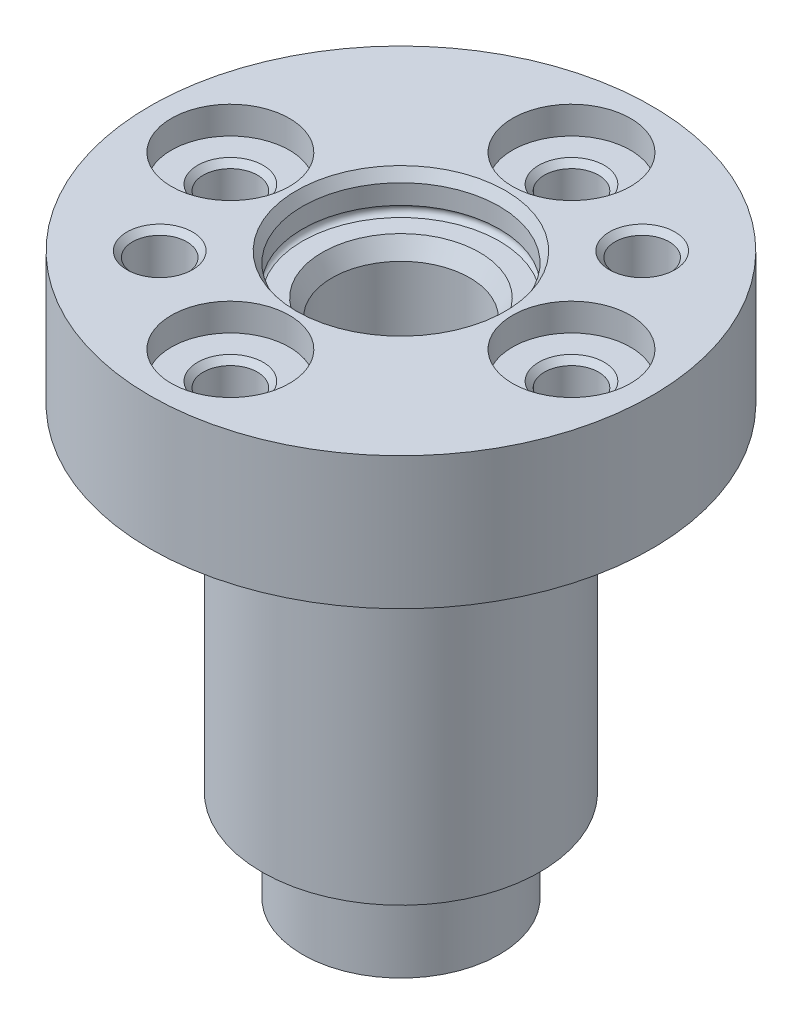
ISO-10303-21;
HEADER;
FILE_DESCRIPTION(('STEP AP214'),'2;1');
FILE_NAME('part.step','',(''),(''),'','','');
FILE_SCHEMA(('AUTOMOTIVE_DESIGN { 1 0 10303 214 1 1 1 1 }'));
ENDSEC;
DATA;
#1=APPLICATION_CONTEXT('core data for automotive mechanical design processes');
#2=APPLICATION_PROTOCOL_DEFINITION('international standard','automotive_design',2000,#1);
#3=PRODUCT_CONTEXT('',#1,'mechanical');
#4=PRODUCT('Part','Part','',(#3));
#5=PRODUCT_RELATED_PRODUCT_CATEGORY('part','',(#4));
#6=PRODUCT_DEFINITION_FORMATION('','',#4);
#7=PRODUCT_DEFINITION_CONTEXT('part definition',#1,'design');
#8=PRODUCT_DEFINITION('design','',#6,#7);
#9=PRODUCT_DEFINITION_SHAPE('','',#8);
#10=(LENGTH_UNIT() NAMED_UNIT(*) SI_UNIT(.MILLI.,.METRE.));
#11=(NAMED_UNIT(*) PLANE_ANGLE_UNIT() SI_UNIT($,.RADIAN.));
#12=(NAMED_UNIT(*) SI_UNIT($,.STERADIAN.) SOLID_ANGLE_UNIT());
#13=UNCERTAINTY_MEASURE_WITH_UNIT(LENGTH_MEASURE(1.E-05),#10,'distance_accuracy_value','');
#14=(GEOMETRIC_REPRESENTATION_CONTEXT(3) GLOBAL_UNCERTAINTY_ASSIGNED_CONTEXT((#13)) GLOBAL_UNIT_ASSIGNED_CONTEXT((#10,
#11,#12)) REPRESENTATION_CONTEXT('',''));
#15=CARTESIAN_POINT('',(0.,0.,0.));
#16=DIRECTION('',(0.,0.,1.));
#17=DIRECTION('',(1.,0.,0.));
#18=AXIS2_PLACEMENT_3D('',#15,#16,#17);
#19=CARTESIAN_POINT('',(0.,0.,0.));
#20=DIRECTION('',(0.,1.,0.));
#21=DIRECTION('',(0.,0.,1.));
#22=AXIS2_PLACEMENT_3D('',#19,#20,#21);
#23=CYLINDRICAL_SURFACE('',#22,10.6);
#24=CARTESIAN_POINT('',(0.,7.,0.));
#25=DIRECTION('',(0.,1.,0.));
#26=DIRECTION('',(0.,0.,1.));
#27=AXIS2_PLACEMENT_3D('',#24,#25,#26);
#28=CIRCLE('',#27,10.6);
#29=CARTESIAN_POINT('',(0.,7.,10.6));
#30=VERTEX_POINT('',#29);
#31=EDGE_CURVE('E145',#30,#30,#28,.T.);
#32=ORIENTED_EDGE('',*,*,#31,.T.);
#33=EDGE_LOOP('',(#32));
#34=FACE_BOUND('',#33,.T.);
#35=CARTESIAN_POINT('',(0.,32.6,0.));
#36=DIRECTION('',(0.,1.,0.));
#37=DIRECTION('',(0.,0.,1.));
#38=AXIS2_PLACEMENT_3D('',#35,#36,#37);
#39=CIRCLE('',#38,10.6);
#40=CARTESIAN_POINT('',(0.,32.6,10.6));
#41=VERTEX_POINT('',#40);
#42=EDGE_CURVE('E140',#41,#41,#39,.T.);
#43=ORIENTED_EDGE('',*,*,#42,.F.);
#44=EDGE_LOOP('',(#43));
#45=FACE_BOUND('',#44,.T.);
#46=DIRECTION('',(0.,1.,0.));
#47=VECTOR('',#46,1.);
#48=CARTESIAN_POINT('',(-10.5741789327541,0.,-0.739418621687728));
#49=LINE('',#48,#47);
#50=CARTESIAN_POINT('',(-10.5741789327541,27.6,-0.739418621687729));
#51=VERTEX_POINT('',#50);
#52=CARTESIAN_POINT('',(-10.5741789327541,22.6,-0.739418621687728));
#53=VERTEX_POINT('',#52);
#54=EDGE_CURVE('E11',#51,#53,#49,.F.);
#55=ORIENTED_EDGE('',*,*,#54,.F.);
#56=CARTESIAN_POINT('',(0.,27.6,0.));
#57=DIRECTION('',(0.,-1.,0.));
#58=DIRECTION('',(0.,0.,-1.));
#59=AXIS2_PLACEMENT_3D('',#56,#57,#58);
#60=CIRCLE('',#59,10.6);
#61=CARTESIAN_POINT('',(-10.5741789327541,27.6,0.739418621687729));
#62=VERTEX_POINT('',#61);
#63=EDGE_CURVE('E51',#62,#51,#60,.T.);
#64=ORIENTED_EDGE('',*,*,#63,.F.);
#65=DIRECTION('',(0.,1.,0.));
#66=VECTOR('',#65,1.);
#67=CARTESIAN_POINT('',(-10.5741789327541,0.,0.739418621687728));
#68=LINE('',#67,#66);
#69=CARTESIAN_POINT('',(-10.5741789327541,22.6,0.739418621687728));
#70=VERTEX_POINT('',#69);
#71=EDGE_CURVE('E142',#62,#70,#68,.F.);
#72=ORIENTED_EDGE('',*,*,#71,.T.);
#73=CARTESIAN_POINT('',(0.,22.6,0.));
#74=DIRECTION('',(0.,1.,0.));
#75=DIRECTION('',(0.,0.,1.));
#76=AXIS2_PLACEMENT_3D('',#73,#74,#75);
#77=CIRCLE('',#76,10.6);
#78=EDGE_CURVE('E151',#53,#70,#77,.T.);
#79=ORIENTED_EDGE('',*,*,#78,.F.);
#80=EDGE_LOOP('',(#55,#64,#72,#79));
#81=FACE_BOUND('',#80,.T.);
#82=ADVANCED_FACE('F43',(#34,#45,#81),#23,.T.);
#83=CARTESIAN_POINT('',(0.,42.7,0.));
#84=DIRECTION('',(0.,-1.,0.));
#85=DIRECTION('',(0.,0.,-1.));
#86=AXIS2_PLACEMENT_3D('',#83,#84,#85);
#87=PLANE('',#86);
#88=CARTESIAN_POINT('',(-9.19238815542515,42.7,9.19238815542515));
#89=DIRECTION('',(0.,1.,0.));
#90=DIRECTION('',(0.,0.,1.));
#91=AXIS2_PLACEMENT_3D('',#88,#89,#90);
#92=CIRCLE('',#91,2.50000000000001);
#93=CARTESIAN_POINT('',(-9.19238815542515,42.7,11.6923881554252));
#94=VERTEX_POINT('',#93);
#95=EDGE_CURVE('E346',#94,#94,#92,.T.);
#96=ORIENTED_EDGE('',*,*,#95,.F.);
#97=EDGE_LOOP('',(#96));
#98=FACE_BOUND('',#97,.T.);
#99=CARTESIAN_POINT('',(9.19238815542515,42.7,-9.19238815542515));
#100=DIRECTION('',(0.,1.,0.));
#101=DIRECTION('',(0.,0.,1.));
#102=AXIS2_PLACEMENT_3D('',#99,#100,#101);
#103=CIRCLE('',#102,2.50000000000001);
#104=CARTESIAN_POINT('',(9.19238815542515,42.7,-6.69238815542515));
#105=VERTEX_POINT('',#104);
#106=EDGE_CURVE('E361',#105,#105,#103,.T.);
#107=ORIENTED_EDGE('',*,*,#106,.F.);
#108=EDGE_LOOP('',(#107));
#109=FACE_BOUND('',#108,.T.);
#110=CARTESIAN_POINT('',(0.,42.7,13.));
#111=DIRECTION('',(0.,1.,0.));
#112=DIRECTION('',(0.,0.,1.));
#113=AXIS2_PLACEMENT_3D('',#110,#111,#112);
#114=CIRCLE('',#113,4.5);
#115=CARTESIAN_POINT('',(0.,42.7,17.5));
#116=VERTEX_POINT('',#115);
#117=EDGE_CURVE('E376',#116,#116,#114,.T.);
#118=ORIENTED_EDGE('',*,*,#117,.F.);
#119=EDGE_LOOP('',(#118));
#120=FACE_BOUND('',#119,.T.);
#121=CARTESIAN_POINT('',(0.,42.7,-13.));
#122=DIRECTION('',(0.,1.,0.));
#123=DIRECTION('',(0.,0.,1.));
#124=AXIS2_PLACEMENT_3D('',#121,#122,#123);
#125=CIRCLE('',#124,4.5);
#126=CARTESIAN_POINT('',(0.,42.7,-8.5));
#127=VERTEX_POINT('',#126);
#128=EDGE_CURVE('E391',#127,#127,#125,.T.);
#129=ORIENTED_EDGE('',*,*,#128,.F.);
#130=EDGE_LOOP('',(#129));
#131=FACE_BOUND('',#130,.T.);
#132=CARTESIAN_POINT('',(-13.,42.7,0.));
#133=DIRECTION('',(0.,1.,0.));
#134=DIRECTION('',(0.,0.,1.));
#135=AXIS2_PLACEMENT_3D('',#132,#133,#134);
#136=CIRCLE('',#135,4.5);
#137=CARTESIAN_POINT('',(-13.,42.7,4.5));
#138=VERTEX_POINT('',#137);
#139=EDGE_CURVE('E406',#138,#138,#136,.T.);
#140=ORIENTED_EDGE('',*,*,#139,.F.);
#141=EDGE_LOOP('',(#140));
#142=FACE_BOUND('',#141,.T.);
#143=CARTESIAN_POINT('',(13.,42.7,0.));
#144=DIRECTION('',(0.,1.,0.));
#145=DIRECTION('',(0.,0.,1.));
#146=AXIS2_PLACEMENT_3D('',#143,#144,#145);
#147=CIRCLE('',#146,4.5);
#148=CARTESIAN_POINT('',(13.,42.7,4.5));
#149=VERTEX_POINT('',#148);
#150=EDGE_CURVE('E421',#149,#149,#147,.T.);
#151=ORIENTED_EDGE('',*,*,#150,.F.);
#152=EDGE_LOOP('',(#151));
#153=FACE_BOUND('',#152,.T.);
#154=CARTESIAN_POINT('',(0.,42.7,0.));
#155=DIRECTION('',(0.,1.,0.));
#156=DIRECTION('',(0.,0.,1.));
#157=AXIS2_PLACEMENT_3D('',#154,#155,#156);
#158=CIRCLE('',#157,7.965);
#159=CARTESIAN_POINT('',(0.,42.7,7.965));
#160=VERTEX_POINT('',#159);
#161=EDGE_CURVE('E444',#160,#160,#158,.T.);
#162=ORIENTED_EDGE('',*,*,#161,.F.);
#163=EDGE_LOOP('',(#162));
#164=FACE_BOUND('',#163,.T.);
#165=CARTESIAN_POINT('',(0.,42.7,0.));
#166=DIRECTION('',(0.,1.,0.));
#167=DIRECTION('',(0.,0.,1.));
#168=AXIS2_PLACEMENT_3D('',#165,#166,#167);
#169=CIRCLE('',#168,19.125);
#170=CARTESIAN_POINT('',(0.,42.7,19.125));
#171=VERTEX_POINT('',#170);
#172=EDGE_CURVE('E136',#171,#171,#169,.T.);
#173=ORIENTED_EDGE('',*,*,#172,.T.);
#174=EDGE_LOOP('',(#173));
#175=FACE_BOUND('',#174,.T.);
#176=ADVANCED_FACE('F45',(#98,#109,#120,#131,#142,#153,#164,#175),#87,.F.);
#177=CARTESIAN_POINT('',(0.,0.,0.));
#178=DIRECTION('',(0.,1.,0.));
#179=DIRECTION('',(0.,0.,1.));
#180=AXIS2_PLACEMENT_3D('',#177,#178,#179);
#181=CYLINDRICAL_SURFACE('',#180,19.125);
#182=ORIENTED_EDGE('',*,*,#172,.F.);
#183=EDGE_LOOP('',(#182));
#184=FACE_BOUND('',#183,.T.);
#185=CARTESIAN_POINT('',(0.,32.6,0.));
#186=DIRECTION('',(0.,1.,0.));
#187=DIRECTION('',(0.,0.,1.));
#188=AXIS2_PLACEMENT_3D('',#185,#186,#187);
#189=CIRCLE('',#188,19.125);
#190=CARTESIAN_POINT('',(0.,32.6,19.125));
#191=VERTEX_POINT('',#190);
#192=EDGE_CURVE('E139',#191,#191,#189,.T.);
#193=ORIENTED_EDGE('',*,*,#192,.T.);
#194=EDGE_LOOP('',(#193));
#195=FACE_BOUND('',#194,.T.);
#196=ADVANCED_FACE('F118',(#184,#195),#181,.T.);
#197=CARTESIAN_POINT('',(19.125,32.6,0.));
#198=DIRECTION('',(0.,1.,0.));
#199=DIRECTION('',(0.,0.,1.));
#200=AXIS2_PLACEMENT_3D('',#197,#198,#199);
#201=PLANE('',#200);
#202=ORIENTED_EDGE('',*,*,#192,.F.);
#203=EDGE_LOOP('',(#202));
#204=FACE_BOUND('',#203,.T.);
#205=ORIENTED_EDGE('',*,*,#42,.T.);
#206=EDGE_LOOP('',(#205));
#207=FACE_BOUND('',#206,.T.);
#208=ADVANCED_FACE('F126',(#204,#207),#201,.F.);
#209=CARTESIAN_POINT('',(10.6,7.,0.));
#210=DIRECTION('',(0.,1.,0.));
#211=DIRECTION('',(0.,0.,1.));
#212=AXIS2_PLACEMENT_3D('',#209,#210,#211);
#213=PLANE('',#212);
#214=ORIENTED_EDGE('',*,*,#31,.F.);
#215=EDGE_LOOP('',(#214));
#216=FACE_BOUND('',#215,.T.);
#217=CARTESIAN_POINT('',(0.,7.,0.));
#218=DIRECTION('',(0.,1.,0.));
#219=DIRECTION('',(0.,0.,1.));
#220=AXIS2_PLACEMENT_3D('',#217,#218,#219);
#221=CIRCLE('',#220,7.5);
#222=CARTESIAN_POINT('',(0.,7.,7.5));
#223=VERTEX_POINT('',#222);
#224=EDGE_CURVE('E184',#223,#223,#221,.T.);
#225=ORIENTED_EDGE('',*,*,#224,.T.);
#226=EDGE_LOOP('',(#225));
#227=FACE_BOUND('',#226,.T.);
#228=ADVANCED_FACE('F124',(#216,#227),#213,.F.);
#229=CARTESIAN_POINT('',(0.,0.,0.));
#230=DIRECTION('',(0.,1.,0.));
#231=DIRECTION('',(0.,0.,1.));
#232=AXIS2_PLACEMENT_3D('',#229,#230,#231);
#233=CYLINDRICAL_SURFACE('',#232,7.5);
#234=ORIENTED_EDGE('',*,*,#224,.F.);
#235=EDGE_LOOP('',(#234));
#236=FACE_BOUND('',#235,.T.);
#237=CARTESIAN_POINT('',(0.,0.,0.));
#238=DIRECTION('',(0.,1.,0.));
#239=DIRECTION('',(0.,0.,1.));
#240=AXIS2_PLACEMENT_3D('',#237,#238,#239);
#241=CIRCLE('',#240,7.5);
#242=CARTESIAN_POINT('',(0.,0.,7.5));
#243=VERTEX_POINT('',#242);
#244=EDGE_CURVE('E181',#243,#243,#241,.T.);
#245=ORIENTED_EDGE('',*,*,#244,.T.);
#246=EDGE_LOOP('',(#245));
#247=FACE_BOUND('',#246,.T.);
#248=ADVANCED_FACE('F190',(#236,#247),#233,.T.);
#249=CARTESIAN_POINT('',(7.5,0.,0.));
#250=DIRECTION('',(0.,1.,0.));
#251=DIRECTION('',(0.,0.,1.));
#252=AXIS2_PLACEMENT_3D('',#249,#250,#251);
#253=PLANE('',#252);
#254=CARTESIAN_POINT('',(0.,0.,0.));
#255=DIRECTION('',(0.,1.,0.));
#256=DIRECTION('',(0.,0.,1.));
#257=AXIS2_PLACEMENT_3D('',#254,#255,#256);
#258=CIRCLE('',#257,6.1160254037844);
#259=CARTESIAN_POINT('',(0.,0.,6.1160254037844));
#260=VERTEX_POINT('',#259);
#261=EDGE_CURVE('E424',#260,#260,#258,.T.);
#262=ORIENTED_EDGE('',*,*,#261,.T.);
#263=EDGE_LOOP('',(#262));
#264=FACE_BOUND('',#263,.T.);
#265=ORIENTED_EDGE('',*,*,#244,.F.);
#266=EDGE_LOOP('',(#265));
#267=FACE_BOUND('',#266,.T.);
#268=ADVANCED_FACE('F195',(#264,#267),#253,.F.);
#269=CARTESIAN_POINT('',(0.,0.,0.));
#270=DIRECTION('',(-0.0697564737441253,0.,0.997564050259824));
#271=DIRECTION('',(0.997564050259824,0.,0.0697564737441253));
#272=AXIS2_PLACEMENT_3D('',#269,#270,#271);
#273=PLANE('',#272);
#274=DIRECTION('',(0.997564050259824,0.,0.0697564737441253));
#275=VECTOR('',#274,1.);
#276=CARTESIAN_POINT('',(0.,27.6,0.));
#277=LINE('',#276,#275);
#278=CARTESIAN_POINT('',(-17.0832843606995,27.6,-1.19457961286815));
#279=VERTEX_POINT('',#278);
#280=EDGE_CURVE('E176',#279,#51,#277,.T.);
#281=ORIENTED_EDGE('',*,*,#280,.T.);
#282=ORIENTED_EDGE('',*,*,#54,.T.);
#283=DIRECTION('',(-0.997564050259824,0.,-0.0697564737441253));
#284=VECTOR('',#283,1.);
#285=CARTESIAN_POINT('',(-17.0832843606995,22.6,-1.19457961286815));
#286=LINE('',#285,#284);
#287=CARTESIAN_POINT('',(-17.0832843606995,22.6,-1.19457961286815));
#288=VERTEX_POINT('',#287);
#289=EDGE_CURVE('E158',#53,#288,#286,.T.);
#290=ORIENTED_EDGE('',*,*,#289,.T.);
#291=DIRECTION('',(0.,1.,0.));
#292=VECTOR('',#291,1.);
#293=CARTESIAN_POINT('',(-17.0832843606995,27.6,-1.19457961286815));
#294=LINE('',#293,#292);
#295=EDGE_CURVE('E169',#288,#279,#294,.T.);
#296=ORIENTED_EDGE('',*,*,#295,.T.);
#297=EDGE_LOOP('',(#281,#282,#290,#296));
#298=FACE_BOUND('',#297,.T.);
#299=ADVANCED_FACE('F199',(#298),#273,.F.);
#300=CARTESIAN_POINT('',(0.,0.,0.));
#301=DIRECTION('',(0.0697564737441253,0.,0.997564050259824));
#302=DIRECTION('',(0.997564050259824,0.,-0.0697564737441253));
#303=AXIS2_PLACEMENT_3D('',#300,#301,#302);
#304=PLANE('',#303);
#305=ORIENTED_EDGE('',*,*,#71,.F.);
#306=DIRECTION('',(0.997564050259824,0.,-0.0697564737441253));
#307=VECTOR('',#306,1.);
#308=CARTESIAN_POINT('',(0.,27.6,0.));
#309=LINE('',#308,#307);
#310=CARTESIAN_POINT('',(-17.0832843606995,27.6,1.19457961286815));
#311=VERTEX_POINT('',#310);
#312=EDGE_CURVE('E163',#311,#62,#309,.T.);
#313=ORIENTED_EDGE('',*,*,#312,.F.);
#314=DIRECTION('',(0.,1.,0.));
#315=VECTOR('',#314,1.);
#316=CARTESIAN_POINT('',(-17.0832843606995,27.6,1.19457961286815));
#317=LINE('',#316,#315);
#318=CARTESIAN_POINT('',(-17.0832843606995,22.6,1.19457961286815));
#319=VERTEX_POINT('',#318);
#320=EDGE_CURVE('E167',#319,#311,#317,.T.);
#321=ORIENTED_EDGE('',*,*,#320,.F.);
#322=DIRECTION('',(-0.997564050259824,0.,0.0697564737441253));
#323=VECTOR('',#322,1.);
#324=CARTESIAN_POINT('',(-17.0832843606995,22.6,1.19457961286815));
#325=LINE('',#324,#323);
#326=EDGE_CURVE('E58',#70,#319,#325,.T.);
#327=ORIENTED_EDGE('',*,*,#326,.F.);
#328=EDGE_LOOP('',(#305,#313,#321,#327));
#329=FACE_BOUND('',#328,.T.);
#330=ADVANCED_FACE('F162',(#329),#304,.T.);
#331=CARTESIAN_POINT('',(0.,27.6,0.));
#332=DIRECTION('',(0.,-1.,0.));
#333=DIRECTION('',(0.,0.,-1.));
#334=AXIS2_PLACEMENT_3D('',#331,#332,#333);
#335=PLANE('',#334);
#336=ORIENTED_EDGE('',*,*,#312,.T.);
#337=ORIENTED_EDGE('',*,*,#63,.T.);
#338=ORIENTED_EDGE('',*,*,#280,.F.);
#339=CARTESIAN_POINT('',(0.,27.6,0.));
#340=DIRECTION('',(0.,1.,0.));
#341=DIRECTION('',(0.,0.,1.));
#342=AXIS2_PLACEMENT_3D('',#339,#340,#341);
#343=CIRCLE('',#342,17.125);
#344=EDGE_CURVE('E165',#279,#311,#343,.T.);
#345=ORIENTED_EDGE('',*,*,#344,.T.);
#346=EDGE_LOOP('',(#336,#337,#338,#345));
#347=FACE_BOUND('',#346,.T.);
#348=ADVANCED_FACE('F164',(#347),#335,.F.);
#349=CARTESIAN_POINT('',(0.,22.6,0.));
#350=DIRECTION('',(0.,1.,0.));
#351=DIRECTION('',(0.,0.,1.));
#352=AXIS2_PLACEMENT_3D('',#349,#350,#351);
#353=CYLINDRICAL_SURFACE('',#352,17.125);
#354=CARTESIAN_POINT('',(0.,22.6,0.));
#355=DIRECTION('',(0.,1.,0.));
#356=DIRECTION('',(0.,0.,1.));
#357=AXIS2_PLACEMENT_3D('',#354,#355,#356);
#358=CIRCLE('',#357,17.125);
#359=EDGE_CURVE('E178',#288,#319,#358,.T.);
#360=ORIENTED_EDGE('',*,*,#359,.T.);
#361=ORIENTED_EDGE('',*,*,#320,.T.);
#362=ORIENTED_EDGE('',*,*,#344,.F.);
#363=ORIENTED_EDGE('',*,*,#295,.F.);
#364=EDGE_LOOP('',(#360,#361,#362,#363));
#365=FACE_BOUND('',#364,.T.);
#366=ADVANCED_FACE('F211',(#365),#353,.T.);
#367=CARTESIAN_POINT('',(-17.0832843606995,22.6,-1.19457961286815));
#368=DIRECTION('',(0.,1.,0.));
#369=DIRECTION('',(0.,0.,1.));
#370=AXIS2_PLACEMENT_3D('',#367,#368,#369);
#371=PLANE('',#370);
#372=ORIENTED_EDGE('',*,*,#289,.F.);
#373=ORIENTED_EDGE('',*,*,#78,.T.);
#374=ORIENTED_EDGE('',*,*,#326,.T.);
#375=ORIENTED_EDGE('',*,*,#359,.F.);
#376=EDGE_LOOP('',(#372,#373,#374,#375));
#377=FACE_BOUND('',#376,.T.);
#378=ADVANCED_FACE('F155',(#377),#371,.F.);
#379=CARTESIAN_POINT('',(0.,41.89459637448,0.));
#380=DIRECTION('',(0.,1.,0.));
#381=DIRECTION('',(0.,0.,1.));
#382=AXIS2_PLACEMENT_3D('',#379,#380,#381);
#383=CONICAL_SURFACE('',#382,7.5,0.523598775598045);
#384=ORIENTED_EDGE('',*,*,#161,.T.);
#385=EDGE_LOOP('',(#384));
#386=FACE_BOUND('',#385,.T.);
#387=CARTESIAN_POINT('',(0.,41.89459637448,0.));
#388=DIRECTION('',(0.,1.,0.));
#389=DIRECTION('',(0.,0.,1.));
#390=AXIS2_PLACEMENT_3D('',#387,#388,#389);
#391=CIRCLE('',#390,7.5);
#392=CARTESIAN_POINT('',(0.,41.89459637448,7.5));
#393=VERTEX_POINT('',#392);
#394=EDGE_CURVE('E441',#393,#393,#391,.T.);
#395=ORIENTED_EDGE('',*,*,#394,.F.);
#396=EDGE_LOOP('',(#395));
#397=FACE_BOUND('',#396,.T.);
#398=ADVANCED_FACE('F216',(#386,#397),#383,.F.);
#399=CARTESIAN_POINT('',(0.,0.,0.));
#400=DIRECTION('',(0.,1.,0.));
#401=DIRECTION('',(0.,0.,1.));
#402=AXIS2_PLACEMENT_3D('',#399,#400,#401);
#403=CYLINDRICAL_SURFACE('',#402,7.5);
#404=ORIENTED_EDGE('',*,*,#394,.T.);
#405=EDGE_LOOP('',(#404));
#406=FACE_BOUND('',#405,.T.);
#407=CARTESIAN_POINT('',(0.,40.4,0.));
#408=DIRECTION('',(0.,1.,0.));
#409=DIRECTION('',(0.,0.,1.));
#410=AXIS2_PLACEMENT_3D('',#407,#408,#409);
#411=CIRCLE('',#410,7.5);
#412=CARTESIAN_POINT('',(0.,40.4,7.5));
#413=VERTEX_POINT('',#412);
#414=EDGE_CURVE('E438',#413,#413,#411,.T.);
#415=ORIENTED_EDGE('',*,*,#414,.F.);
#416=EDGE_LOOP('',(#415));
#417=FACE_BOUND('',#416,.T.);
#418=ADVANCED_FACE('F222',(#406,#417),#403,.F.);
#419=CARTESIAN_POINT('',(0.,40.,0.));
#420=DIRECTION('',(0.,1.,0.));
#421=DIRECTION('',(0.,0.,1.));
#422=AXIS2_PLACEMENT_3D('',#419,#420,#421);
#423=TOROIDAL_SURFACE('',#422,7.38333333333334,0.416666666666663);
#424=ORIENTED_EDGE('',*,*,#414,.T.);
#425=EDGE_LOOP('',(#424));
#426=FACE_BOUND('',#425,.T.);
#427=CARTESIAN_POINT('',(0.,39.6,0.));
#428=DIRECTION('',(0.,1.,0.));
#429=DIRECTION('',(0.,0.,1.));
#430=AXIS2_PLACEMENT_3D('',#427,#428,#429);
#431=CIRCLE('',#430,7.5);
#432=CARTESIAN_POINT('',(0.,39.6,7.5));
#433=VERTEX_POINT('',#432);
#434=EDGE_CURVE('E435',#433,#433,#431,.T.);
#435=ORIENTED_EDGE('',*,*,#434,.F.);
#436=EDGE_LOOP('',(#435));
#437=FACE_BOUND('',#436,.T.);
#438=ADVANCED_FACE('F226',(#426,#437),#423,.F.);
#439=CARTESIAN_POINT('',(7.5,39.6,0.));
#440=DIRECTION('',(0.,1.,0.));
#441=DIRECTION('',(0.,0.,1.));
#442=AXIS2_PLACEMENT_3D('',#439,#440,#441);
#443=PLANE('',#442);
#444=ORIENTED_EDGE('',*,*,#434,.T.);
#445=EDGE_LOOP('',(#444));
#446=FACE_BOUND('',#445,.T.);
#447=CARTESIAN_POINT('',(0.,39.6,0.));
#448=DIRECTION('',(0.,1.,0.));
#449=DIRECTION('',(0.,0.,1.));
#450=AXIS2_PLACEMENT_3D('',#447,#448,#449);
#451=CIRCLE('',#450,6.0005553499465);
#452=CARTESIAN_POINT('',(0.,39.6,6.0005553499465));
#453=VERTEX_POINT('',#452);
#454=EDGE_CURVE('E432',#453,#453,#451,.T.);
#455=ORIENTED_EDGE('',*,*,#454,.F.);
#456=EDGE_LOOP('',(#455));
#457=FACE_BOUND('',#456,.T.);
#458=ADVANCED_FACE('F230',(#446,#457),#443,.T.);
#459=CARTESIAN_POINT('',(0.,38.3,0.));
#460=DIRECTION('',(0.,1.,0.));
#461=DIRECTION('',(0.,0.,1.));
#462=AXIS2_PLACEMENT_3D('',#459,#460,#461);
#463=CONICAL_SURFACE('',#462,5.25,0.52359877559829);
#464=ORIENTED_EDGE('',*,*,#454,.T.);
#465=EDGE_LOOP('',(#464));
#466=FACE_BOUND('',#465,.T.);
#467=CARTESIAN_POINT('',(0.,38.3,0.));
#468=DIRECTION('',(0.,1.,0.));
#469=DIRECTION('',(0.,0.,1.));
#470=AXIS2_PLACEMENT_3D('',#467,#468,#469);
#471=CIRCLE('',#470,5.25);
#472=CARTESIAN_POINT('',(0.,38.3,5.25));
#473=VERTEX_POINT('',#472);
#474=EDGE_CURVE('E429',#473,#473,#471,.T.);
#475=ORIENTED_EDGE('',*,*,#474,.F.);
#476=EDGE_LOOP('',(#475));
#477=FACE_BOUND('',#476,.T.);
#478=ADVANCED_FACE('F234',(#466,#477),#463,.F.);
#479=CARTESIAN_POINT('',(0.,0.,0.));
#480=DIRECTION('',(0.,1.,0.));
#481=DIRECTION('',(0.,0.,1.));
#482=AXIS2_PLACEMENT_3D('',#479,#480,#481);
#483=CYLINDRICAL_SURFACE('',#482,5.25);
#484=ORIENTED_EDGE('',*,*,#474,.T.);
#485=EDGE_LOOP('',(#484));
#486=FACE_BOUND('',#485,.T.);
#487=CARTESIAN_POINT('',(0.,1.5,0.));
#488=DIRECTION('',(0.,1.,0.));
#489=DIRECTION('',(0.,0.,1.));
#490=AXIS2_PLACEMENT_3D('',#487,#488,#489);
#491=CIRCLE('',#490,5.25);
#492=CARTESIAN_POINT('',(0.,1.5,5.25));
#493=VERTEX_POINT('',#492);
#494=EDGE_CURVE('E426',#493,#493,#491,.T.);
#495=ORIENTED_EDGE('',*,*,#494,.F.);
#496=EDGE_LOOP('',(#495));
#497=FACE_BOUND('',#496,.T.);
#498=ADVANCED_FACE('F238',(#486,#497),#483,.F.);
#499=CARTESIAN_POINT('',(0.,0.,0.));
#500=DIRECTION('',(0.,-1.,0.));
#501=DIRECTION('',(0.,0.,-1.));
#502=AXIS2_PLACEMENT_3D('',#499,#500,#501);
#503=CONICAL_SURFACE('',#502,6.1160254037844,0.52359877559828);
#504=ORIENTED_EDGE('',*,*,#494,.T.);
#505=EDGE_LOOP('',(#504));
#506=FACE_BOUND('',#505,.T.);
#507=ORIENTED_EDGE('',*,*,#261,.F.);
#508=EDGE_LOOP('',(#507));
#509=FACE_BOUND('',#508,.T.);
#510=ADVANCED_FACE('F242',(#506,#509),#503,.F.);
#511=CARTESIAN_POINT('',(13.,33.406616993585,0.));
#512=DIRECTION('',(0.,1.,0.));
#513=DIRECTION('',(0.,0.,1.));
#514=AXIS2_PLACEMENT_3D('',#511,#512,#513);
#515=CYLINDRICAL_SURFACE('',#514,4.5);
#516=ORIENTED_EDGE('',*,*,#150,.T.);
#517=EDGE_LOOP('',(#516));
#518=FACE_BOUND('',#517,.T.);
#519=CARTESIAN_POINT('',(13.,40.6,0.));
#520=DIRECTION('',(0.,1.,0.));
#521=DIRECTION('',(0.,0.,1.));
#522=AXIS2_PLACEMENT_3D('',#519,#520,#521);
#523=CIRCLE('',#522,4.5);
#524=CARTESIAN_POINT('',(13.,40.6,4.5));
#525=VERTEX_POINT('',#524);
#526=EDGE_CURVE('E418',#525,#525,#523,.T.);
#527=ORIENTED_EDGE('',*,*,#526,.F.);
#528=EDGE_LOOP('',(#527));
#529=FACE_BOUND('',#528,.T.);
#530=ADVANCED_FACE('F246',(#518,#529),#515,.F.);
#531=CARTESIAN_POINT('',(17.5,40.6,0.));
#532=DIRECTION('',(0.,1.,0.));
#533=DIRECTION('',(0.,0.,1.));
#534=AXIS2_PLACEMENT_3D('',#531,#532,#533);
#535=PLANE('',#534);
#536=ORIENTED_EDGE('',*,*,#526,.T.);
#537=EDGE_LOOP('',(#536));
#538=FACE_BOUND('',#537,.T.);
#539=CARTESIAN_POINT('',(13.,40.6,0.));
#540=DIRECTION('',(0.,1.,0.));
#541=DIRECTION('',(0.,0.,1.));
#542=AXIS2_PLACEMENT_3D('',#539,#540,#541);
#543=CIRCLE('',#542,2.5);
#544=CARTESIAN_POINT('',(13.,40.6,2.5));
#545=VERTEX_POINT('',#544);
#546=EDGE_CURVE('E415',#545,#545,#543,.T.);
#547=ORIENTED_EDGE('',*,*,#546,.F.);
#548=EDGE_LOOP('',(#547));
#549=FACE_BOUND('',#548,.T.);
#550=ADVANCED_FACE('F250',(#538,#549),#535,.T.);
#551=CARTESIAN_POINT('',(13.,40.167,0.));
#552=DIRECTION('',(0.,1.,0.));
#553=DIRECTION('',(0.,0.,1.));
#554=AXIS2_PLACEMENT_3D('',#551,#552,#553);
#555=CONICAL_SURFACE('',#554,2.067,0.785398163397444);
#556=ORIENTED_EDGE('',*,*,#546,.T.);
#557=EDGE_LOOP('',(#556));
#558=FACE_BOUND('',#557,.T.);
#559=CARTESIAN_POINT('',(13.,40.167,0.));
#560=DIRECTION('',(0.,1.,0.));
#561=DIRECTION('',(0.,0.,1.));
#562=AXIS2_PLACEMENT_3D('',#559,#560,#561);
#563=CIRCLE('',#562,2.067);
#564=CARTESIAN_POINT('',(13.,40.167,2.067));
#565=VERTEX_POINT('',#564);
#566=EDGE_CURVE('E412',#565,#565,#563,.T.);
#567=ORIENTED_EDGE('',*,*,#566,.F.);
#568=EDGE_LOOP('',(#567));
#569=FACE_BOUND('',#568,.T.);
#570=ADVANCED_FACE('F254',(#558,#569),#555,.F.);
#571=CARTESIAN_POINT('',(13.,33.406616993585,0.));
#572=DIRECTION('',(0.,1.,0.));
#573=DIRECTION('',(0.,0.,1.));
#574=AXIS2_PLACEMENT_3D('',#571,#572,#573);
#575=CYLINDRICAL_SURFACE('',#574,2.067);
#576=ORIENTED_EDGE('',*,*,#566,.T.);
#577=EDGE_LOOP('',(#576));
#578=FACE_BOUND('',#577,.T.);
#579=CARTESIAN_POINT('',(13.,34.6,0.));
#580=DIRECTION('',(0.,1.,0.));
#581=DIRECTION('',(0.,0.,1.));
#582=AXIS2_PLACEMENT_3D('',#579,#580,#581);
#583=CIRCLE('',#582,2.067);
#584=CARTESIAN_POINT('',(13.,34.6,2.067));
#585=VERTEX_POINT('',#584);
#586=EDGE_CURVE('E409',#585,#585,#583,.T.);
#587=ORIENTED_EDGE('',*,*,#586,.F.);
#588=EDGE_LOOP('',(#587));
#589=FACE_BOUND('',#588,.T.);
#590=ADVANCED_FACE('F258',(#578,#589),#575,.F.);
#591=CARTESIAN_POINT('',(13.,33.406616993585,0.));
#592=DIRECTION('',(0.,1.,0.));
#593=DIRECTION('',(0.,0.,1.));
#594=AXIS2_PLACEMENT_3D('',#591,#592,#593);
#595=CONICAL_SURFACE('',#594,0.,1.04719755119658);
#596=ORIENTED_EDGE('',*,*,#586,.T.);
#597=EDGE_LOOP('',(#596));
#598=FACE_BOUND('',#597,.T.);
#599=CARTESIAN_POINT('',(13.,33.406616993585,0.));
#600=VERTEX_POINT('',#599);
#601=VERTEX_LOOP('',#600);
#602=FACE_BOUND('',#601,.T.);
#603=ADVANCED_FACE('F262',(#598,#602),#595,.F.);
#604=CARTESIAN_POINT('',(-13.,33.406616993585,0.));
#605=DIRECTION('',(0.,1.,0.));
#606=DIRECTION('',(0.,0.,1.));
#607=AXIS2_PLACEMENT_3D('',#604,#605,#606);
#608=CYLINDRICAL_SURFACE('',#607,4.5);
#609=ORIENTED_EDGE('',*,*,#139,.T.);
#610=EDGE_LOOP('',(#609));
#611=FACE_BOUND('',#610,.T.);
#612=CARTESIAN_POINT('',(-13.,40.6,0.));
#613=DIRECTION('',(0.,1.,0.));
#614=DIRECTION('',(0.,0.,1.));
#615=AXIS2_PLACEMENT_3D('',#612,#613,#614);
#616=CIRCLE('',#615,4.5);
#617=CARTESIAN_POINT('',(-13.,40.6,4.5));
#618=VERTEX_POINT('',#617);
#619=EDGE_CURVE('E403',#618,#618,#616,.T.);
#620=ORIENTED_EDGE('',*,*,#619,.F.);
#621=EDGE_LOOP('',(#620));
#622=FACE_BOUND('',#621,.T.);
#623=ADVANCED_FACE('F266',(#611,#622),#608,.F.);
#624=CARTESIAN_POINT('',(-8.5,40.6,0.));
#625=DIRECTION('',(0.,1.,0.));
#626=DIRECTION('',(0.,0.,1.));
#627=AXIS2_PLACEMENT_3D('',#624,#625,#626);
#628=PLANE('',#627);
#629=ORIENTED_EDGE('',*,*,#619,.T.);
#630=EDGE_LOOP('',(#629));
#631=FACE_BOUND('',#630,.T.);
#632=CARTESIAN_POINT('',(-13.,40.6,0.));
#633=DIRECTION('',(0.,1.,0.));
#634=DIRECTION('',(0.,0.,1.));
#635=AXIS2_PLACEMENT_3D('',#632,#633,#634);
#636=CIRCLE('',#635,2.5);
#637=CARTESIAN_POINT('',(-13.,40.6,2.5));
#638=VERTEX_POINT('',#637);
#639=EDGE_CURVE('E400',#638,#638,#636,.T.);
#640=ORIENTED_EDGE('',*,*,#639,.F.);
#641=EDGE_LOOP('',(#640));
#642=FACE_BOUND('',#641,.T.);
#643=ADVANCED_FACE('F270',(#631,#642),#628,.T.);
#644=CARTESIAN_POINT('',(-13.,40.167,0.));
#645=DIRECTION('',(0.,1.,0.));
#646=DIRECTION('',(0.,0.,1.));
#647=AXIS2_PLACEMENT_3D('',#644,#645,#646);
#648=CONICAL_SURFACE('',#647,2.067,0.785398163397444);
#649=ORIENTED_EDGE('',*,*,#639,.T.);
#650=EDGE_LOOP('',(#649));
#651=FACE_BOUND('',#650,.T.);
#652=CARTESIAN_POINT('',(-13.,40.167,0.));
#653=DIRECTION('',(0.,1.,0.));
#654=DIRECTION('',(0.,0.,1.));
#655=AXIS2_PLACEMENT_3D('',#652,#653,#654);
#656=CIRCLE('',#655,2.067);
#657=CARTESIAN_POINT('',(-13.,40.167,2.067));
#658=VERTEX_POINT('',#657);
#659=EDGE_CURVE('E397',#658,#658,#656,.T.);
#660=ORIENTED_EDGE('',*,*,#659,.F.);
#661=EDGE_LOOP('',(#660));
#662=FACE_BOUND('',#661,.T.);
#663=ADVANCED_FACE('F274',(#651,#662),#648,.F.);
#664=CARTESIAN_POINT('',(-13.,33.406616993585,0.));
#665=DIRECTION('',(0.,1.,0.));
#666=DIRECTION('',(0.,0.,1.));
#667=AXIS2_PLACEMENT_3D('',#664,#665,#666);
#668=CYLINDRICAL_SURFACE('',#667,2.067);
#669=ORIENTED_EDGE('',*,*,#659,.T.);
#670=EDGE_LOOP('',(#669));
#671=FACE_BOUND('',#670,.T.);
#672=CARTESIAN_POINT('',(-13.,34.6,0.));
#673=DIRECTION('',(0.,1.,0.));
#674=DIRECTION('',(0.,0.,1.));
#675=AXIS2_PLACEMENT_3D('',#672,#673,#674);
#676=CIRCLE('',#675,2.067);
#677=CARTESIAN_POINT('',(-13.,34.6,2.067));
#678=VERTEX_POINT('',#677);
#679=EDGE_CURVE('E394',#678,#678,#676,.T.);
#680=ORIENTED_EDGE('',*,*,#679,.F.);
#681=EDGE_LOOP('',(#680));
#682=FACE_BOUND('',#681,.T.);
#683=ADVANCED_FACE('F278',(#671,#682),#668,.F.);
#684=CARTESIAN_POINT('',(-13.,33.406616993585,0.));
#685=DIRECTION('',(0.,1.,0.));
#686=DIRECTION('',(0.,0.,1.));
#687=AXIS2_PLACEMENT_3D('',#684,#685,#686);
#688=CONICAL_SURFACE('',#687,0.,1.04719755119658);
#689=ORIENTED_EDGE('',*,*,#679,.T.);
#690=EDGE_LOOP('',(#689));
#691=FACE_BOUND('',#690,.T.);
#692=CARTESIAN_POINT('',(-13.,33.406616993585,0.));
#693=VERTEX_POINT('',#692);
#694=VERTEX_LOOP('',#693);
#695=FACE_BOUND('',#694,.T.);
#696=ADVANCED_FACE('F282',(#691,#695),#688,.F.);
#697=CARTESIAN_POINT('',(0.,33.406616993585,-13.));
#698=DIRECTION('',(0.,1.,0.));
#699=DIRECTION('',(0.,0.,1.));
#700=AXIS2_PLACEMENT_3D('',#697,#698,#699);
#701=CYLINDRICAL_SURFACE('',#700,4.5);
#702=ORIENTED_EDGE('',*,*,#128,.T.);
#703=EDGE_LOOP('',(#702));
#704=FACE_BOUND('',#703,.T.);
#705=CARTESIAN_POINT('',(0.,40.6,-13.));
#706=DIRECTION('',(0.,1.,0.));
#707=DIRECTION('',(0.,0.,1.));
#708=AXIS2_PLACEMENT_3D('',#705,#706,#707);
#709=CIRCLE('',#708,4.5);
#710=CARTESIAN_POINT('',(0.,40.6,-8.5));
#711=VERTEX_POINT('',#710);
#712=EDGE_CURVE('E388',#711,#711,#709,.T.);
#713=ORIENTED_EDGE('',*,*,#712,.F.);
#714=EDGE_LOOP('',(#713));
#715=FACE_BOUND('',#714,.T.);
#716=ADVANCED_FACE('F286',(#704,#715),#701,.F.);
#717=CARTESIAN_POINT('',(0.,40.6,-17.5));
#718=DIRECTION('',(0.,1.,0.));
#719=DIRECTION('',(0.,0.,1.));
#720=AXIS2_PLACEMENT_3D('',#717,#718,#719);
#721=PLANE('',#720);
#722=ORIENTED_EDGE('',*,*,#712,.T.);
#723=EDGE_LOOP('',(#722));
#724=FACE_BOUND('',#723,.T.);
#725=CARTESIAN_POINT('',(0.,40.6,-13.));
#726=DIRECTION('',(0.,1.,0.));
#727=DIRECTION('',(0.,0.,1.));
#728=AXIS2_PLACEMENT_3D('',#725,#726,#727);
#729=CIRCLE('',#728,2.5);
#730=CARTESIAN_POINT('',(0.,40.6,-10.5));
#731=VERTEX_POINT('',#730);
#732=EDGE_CURVE('E385',#731,#731,#729,.T.);
#733=ORIENTED_EDGE('',*,*,#732,.F.);
#734=EDGE_LOOP('',(#733));
#735=FACE_BOUND('',#734,.T.);
#736=ADVANCED_FACE('F290',(#724,#735),#721,.T.);
#737=CARTESIAN_POINT('',(0.,40.167,-13.));
#738=DIRECTION('',(0.,1.,0.));
#739=DIRECTION('',(0.,0.,1.));
#740=AXIS2_PLACEMENT_3D('',#737,#738,#739);
#741=CONICAL_SURFACE('',#740,2.067,0.785398163397444);
#742=ORIENTED_EDGE('',*,*,#732,.T.);
#743=EDGE_LOOP('',(#742));
#744=FACE_BOUND('',#743,.T.);
#745=CARTESIAN_POINT('',(0.,40.167,-13.));
#746=DIRECTION('',(0.,1.,0.));
#747=DIRECTION('',(0.,0.,1.));
#748=AXIS2_PLACEMENT_3D('',#745,#746,#747);
#749=CIRCLE('',#748,2.067);
#750=CARTESIAN_POINT('',(0.,40.167,-10.933));
#751=VERTEX_POINT('',#750);
#752=EDGE_CURVE('E382',#751,#751,#749,.T.);
#753=ORIENTED_EDGE('',*,*,#752,.F.);
#754=EDGE_LOOP('',(#753));
#755=FACE_BOUND('',#754,.T.);
#756=ADVANCED_FACE('F294',(#744,#755),#741,.F.);
#757=CARTESIAN_POINT('',(0.,33.406616993585,-13.));
#758=DIRECTION('',(0.,1.,0.));
#759=DIRECTION('',(0.,0.,1.));
#760=AXIS2_PLACEMENT_3D('',#757,#758,#759);
#761=CYLINDRICAL_SURFACE('',#760,2.067);
#762=ORIENTED_EDGE('',*,*,#752,.T.);
#763=EDGE_LOOP('',(#762));
#764=FACE_BOUND('',#763,.T.);
#765=CARTESIAN_POINT('',(0.,34.6,-13.));
#766=DIRECTION('',(0.,1.,0.));
#767=DIRECTION('',(0.,0.,1.));
#768=AXIS2_PLACEMENT_3D('',#765,#766,#767);
#769=CIRCLE('',#768,2.067);
#770=CARTESIAN_POINT('',(0.,34.6,-10.933));
#771=VERTEX_POINT('',#770);
#772=EDGE_CURVE('E379',#771,#771,#769,.T.);
#773=ORIENTED_EDGE('',*,*,#772,.F.);
#774=EDGE_LOOP('',(#773));
#775=FACE_BOUND('',#774,.T.);
#776=ADVANCED_FACE('F298',(#764,#775),#761,.F.);
#777=CARTESIAN_POINT('',(0.,33.406616993585,-13.));
#778=DIRECTION('',(0.,1.,0.));
#779=DIRECTION('',(0.,0.,1.));
#780=AXIS2_PLACEMENT_3D('',#777,#778,#779);
#781=CONICAL_SURFACE('',#780,0.,1.04719755119658);
#782=ORIENTED_EDGE('',*,*,#772,.T.);
#783=EDGE_LOOP('',(#782));
#784=FACE_BOUND('',#783,.T.);
#785=CARTESIAN_POINT('',(0.,33.406616993585,-13.));
#786=VERTEX_POINT('',#785);
#787=VERTEX_LOOP('',#786);
#788=FACE_BOUND('',#787,.T.);
#789=ADVANCED_FACE('F302',(#784,#788),#781,.F.);
#790=CARTESIAN_POINT('',(0.,33.406616993585,13.));
#791=DIRECTION('',(0.,1.,0.));
#792=DIRECTION('',(0.,0.,1.));
#793=AXIS2_PLACEMENT_3D('',#790,#791,#792);
#794=CYLINDRICAL_SURFACE('',#793,4.5);
#795=ORIENTED_EDGE('',*,*,#117,.T.);
#796=EDGE_LOOP('',(#795));
#797=FACE_BOUND('',#796,.T.);
#798=CARTESIAN_POINT('',(0.,40.6,13.));
#799=DIRECTION('',(0.,1.,0.));
#800=DIRECTION('',(0.,0.,1.));
#801=AXIS2_PLACEMENT_3D('',#798,#799,#800);
#802=CIRCLE('',#801,4.5);
#803=CARTESIAN_POINT('',(0.,40.6,17.5));
#804=VERTEX_POINT('',#803);
#805=EDGE_CURVE('E373',#804,#804,#802,.T.);
#806=ORIENTED_EDGE('',*,*,#805,.F.);
#807=EDGE_LOOP('',(#806));
#808=FACE_BOUND('',#807,.T.);
#809=ADVANCED_FACE('F306',(#797,#808),#794,.F.);
#810=CARTESIAN_POINT('',(0.,40.6,8.5));
#811=DIRECTION('',(0.,1.,0.));
#812=DIRECTION('',(0.,0.,1.));
#813=AXIS2_PLACEMENT_3D('',#810,#811,#812);
#814=PLANE('',#813);
#815=ORIENTED_EDGE('',*,*,#805,.T.);
#816=EDGE_LOOP('',(#815));
#817=FACE_BOUND('',#816,.T.);
#818=CARTESIAN_POINT('',(0.,40.6,13.));
#819=DIRECTION('',(0.,1.,0.));
#820=DIRECTION('',(0.,0.,1.));
#821=AXIS2_PLACEMENT_3D('',#818,#819,#820);
#822=CIRCLE('',#821,2.5);
#823=CARTESIAN_POINT('',(0.,40.6,15.5));
#824=VERTEX_POINT('',#823);
#825=EDGE_CURVE('E370',#824,#824,#822,.T.);
#826=ORIENTED_EDGE('',*,*,#825,.F.);
#827=EDGE_LOOP('',(#826));
#828=FACE_BOUND('',#827,.T.);
#829=ADVANCED_FACE('F310',(#817,#828),#814,.T.);
#830=CARTESIAN_POINT('',(0.,40.167,13.));
#831=DIRECTION('',(0.,1.,0.));
#832=DIRECTION('',(0.,0.,1.));
#833=AXIS2_PLACEMENT_3D('',#830,#831,#832);
#834=CONICAL_SURFACE('',#833,2.067,0.785398163397444);
#835=ORIENTED_EDGE('',*,*,#825,.T.);
#836=EDGE_LOOP('',(#835));
#837=FACE_BOUND('',#836,.T.);
#838=CARTESIAN_POINT('',(0.,40.167,13.));
#839=DIRECTION('',(0.,1.,0.));
#840=DIRECTION('',(0.,0.,1.));
#841=AXIS2_PLACEMENT_3D('',#838,#839,#840);
#842=CIRCLE('',#841,2.067);
#843=CARTESIAN_POINT('',(0.,40.167,15.067));
#844=VERTEX_POINT('',#843);
#845=EDGE_CURVE('E367',#844,#844,#842,.T.);
#846=ORIENTED_EDGE('',*,*,#845,.F.);
#847=EDGE_LOOP('',(#846));
#848=FACE_BOUND('',#847,.T.);
#849=ADVANCED_FACE('F314',(#837,#848),#834,.F.);
#850=CARTESIAN_POINT('',(0.,33.406616993585,13.));
#851=DIRECTION('',(0.,1.,0.));
#852=DIRECTION('',(0.,0.,1.));
#853=AXIS2_PLACEMENT_3D('',#850,#851,#852);
#854=CYLINDRICAL_SURFACE('',#853,2.067);
#855=ORIENTED_EDGE('',*,*,#845,.T.);
#856=EDGE_LOOP('',(#855));
#857=FACE_BOUND('',#856,.T.);
#858=CARTESIAN_POINT('',(0.,34.6,13.));
#859=DIRECTION('',(0.,1.,0.));
#860=DIRECTION('',(0.,0.,1.));
#861=AXIS2_PLACEMENT_3D('',#858,#859,#860);
#862=CIRCLE('',#861,2.067);
#863=CARTESIAN_POINT('',(0.,34.6,15.067));
#864=VERTEX_POINT('',#863);
#865=EDGE_CURVE('E364',#864,#864,#862,.T.);
#866=ORIENTED_EDGE('',*,*,#865,.F.);
#867=EDGE_LOOP('',(#866));
#868=FACE_BOUND('',#867,.T.);
#869=ADVANCED_FACE('F318',(#857,#868),#854,.F.);
#870=CARTESIAN_POINT('',(0.,33.406616993585,13.));
#871=DIRECTION('',(0.,1.,0.));
#872=DIRECTION('',(0.,0.,1.));
#873=AXIS2_PLACEMENT_3D('',#870,#871,#872);
#874=CONICAL_SURFACE('',#873,0.,1.04719755119658);
#875=ORIENTED_EDGE('',*,*,#865,.T.);
#876=EDGE_LOOP('',(#875));
#877=FACE_BOUND('',#876,.T.);
#878=CARTESIAN_POINT('',(0.,33.406616993585,13.));
#879=VERTEX_POINT('',#878);
#880=VERTEX_LOOP('',#879);
#881=FACE_BOUND('',#880,.T.);
#882=ADVANCED_FACE('F322',(#877,#881),#874,.F.);
#883=CARTESIAN_POINT('',(9.19238815542515,42.267,-9.19238815542515));
#884=DIRECTION('',(0.,1.,0.));
#885=DIRECTION('',(0.,0.,1.));
#886=AXIS2_PLACEMENT_3D('',#883,#884,#885);
#887=CONICAL_SURFACE('',#886,2.06700000000001,0.785398163397452);
#888=ORIENTED_EDGE('',*,*,#106,.T.);
#889=EDGE_LOOP('',(#888));
#890=FACE_BOUND('',#889,.T.);
#891=CARTESIAN_POINT('',(9.19238815542515,42.267,-9.19238815542515));
#892=DIRECTION('',(0.,1.,0.));
#893=DIRECTION('',(0.,0.,1.));
#894=AXIS2_PLACEMENT_3D('',#891,#892,#893);
#895=CIRCLE('',#894,2.06700000000001);
#896=CARTESIAN_POINT('',(9.19238815542515,42.267,-7.12538815542515));
#897=VERTEX_POINT('',#896);
#898=EDGE_CURVE('E358',#897,#897,#895,.T.);
#899=ORIENTED_EDGE('',*,*,#898,.F.);
#900=EDGE_LOOP('',(#899));
#901=FACE_BOUND('',#900,.T.);
#902=ADVANCED_FACE('F326',(#890,#901),#887,.F.);
#903=CARTESIAN_POINT('',(9.19238815542515,33.406616993585,-9.19238815542515));
#904=DIRECTION('',(0.,1.,0.));
#905=DIRECTION('',(0.,0.,1.));
#906=AXIS2_PLACEMENT_3D('',#903,#904,#905);
#907=CYLINDRICAL_SURFACE('',#906,2.06700000000001);
#908=ORIENTED_EDGE('',*,*,#898,.T.);
#909=EDGE_LOOP('',(#908));
#910=FACE_BOUND('',#909,.T.);
#911=CARTESIAN_POINT('',(9.19238815542515,34.6,-9.19238815542515));
#912=DIRECTION('',(0.,1.,0.));
#913=DIRECTION('',(0.,0.,1.));
#914=AXIS2_PLACEMENT_3D('',#911,#912,#913);
#915=CIRCLE('',#914,2.06700000000001);
#916=CARTESIAN_POINT('',(9.19238815542515,34.6,-7.12538815542515));
#917=VERTEX_POINT('',#916);
#918=EDGE_CURVE('E352',#917,#917,#915,.T.);
#919=ORIENTED_EDGE('',*,*,#918,.F.);
#920=EDGE_LOOP('',(#919));
#921=FACE_BOUND('',#920,.T.);
#922=ADVANCED_FACE('F330',(#910,#921),#907,.F.);
#923=CARTESIAN_POINT('',(9.19238815542515,33.406616993585,-9.19238815542515));
#924=DIRECTION('',(0.,1.,0.));
#925=DIRECTION('',(0.,0.,1.));
#926=AXIS2_PLACEMENT_3D('',#923,#924,#925);
#927=CONICAL_SURFACE('',#926,0.,1.04719755119658);
#928=ORIENTED_EDGE('',*,*,#918,.T.);
#929=EDGE_LOOP('',(#928));
#930=FACE_BOUND('',#929,.T.);
#931=CARTESIAN_POINT('',(9.19238815542515,33.406616993585,-9.19238815542515));
#932=VERTEX_POINT('',#931);
#933=VERTEX_LOOP('',#932);
#934=FACE_BOUND('',#933,.T.);
#935=ADVANCED_FACE('F334',(#930,#934),#927,.F.);
#936=CARTESIAN_POINT('',(-9.19238815542515,42.267,9.19238815542515));
#937=DIRECTION('',(0.,1.,0.));
#938=DIRECTION('',(0.,0.,1.));
#939=AXIS2_PLACEMENT_3D('',#936,#937,#938);
#940=CONICAL_SURFACE('',#939,2.06700000000001,0.785398163397452);
#941=ORIENTED_EDGE('',*,*,#95,.T.);
#942=EDGE_LOOP('',(#941));
#943=FACE_BOUND('',#942,.T.);
#944=CARTESIAN_POINT('',(-9.19238815542515,42.267,9.19238815542515));
#945=DIRECTION('',(0.,1.,0.));
#946=DIRECTION('',(0.,0.,1.));
#947=AXIS2_PLACEMENT_3D('',#944,#945,#946);
#948=CIRCLE('',#947,2.06700000000001);
#949=CARTESIAN_POINT('',(-9.19238815542515,42.267,11.2593881554252));
#950=VERTEX_POINT('',#949);
#951=EDGE_CURVE('E349',#950,#950,#948,.T.);
#952=ORIENTED_EDGE('',*,*,#951,.F.);
#953=EDGE_LOOP('',(#952));
#954=FACE_BOUND('',#953,.T.);
#955=ADVANCED_FACE('F108',(#943,#954),#940,.F.);
#956=CARTESIAN_POINT('',(-9.19238815542515,33.406616993585,9.19238815542515));
#957=DIRECTION('',(0.,1.,0.));
#958=DIRECTION('',(0.,0.,1.));
#959=AXIS2_PLACEMENT_3D('',#956,#957,#958);
#960=CYLINDRICAL_SURFACE('',#959,2.06700000000001);
#961=ORIENTED_EDGE('',*,*,#951,.T.);
#962=EDGE_LOOP('',(#961));
#963=FACE_BOUND('',#962,.T.);
#964=CARTESIAN_POINT('',(-9.19238815542515,34.6,9.19238815542515));
#965=DIRECTION('',(0.,1.,0.));
#966=DIRECTION('',(0.,0.,1.));
#967=AXIS2_PLACEMENT_3D('',#964,#965,#966);
#968=CIRCLE('',#967,2.06700000000001);
#969=CARTESIAN_POINT('',(-9.19238815542515,34.6,11.2593881554252));
#970=VERTEX_POINT('',#969);
#971=EDGE_CURVE('E350',#970,#970,#968,.T.);
#972=ORIENTED_EDGE('',*,*,#971,.F.);
#973=EDGE_LOOP('',(#972));
#974=FACE_BOUND('',#973,.T.);
#975=ADVANCED_FACE('F102',(#963,#974),#960,.F.);
#976=CARTESIAN_POINT('',(-9.19238815542515,33.406616993585,9.19238815542515));
#977=DIRECTION('',(0.,1.,0.));
#978=DIRECTION('',(0.,0.,1.));
#979=AXIS2_PLACEMENT_3D('',#976,#977,#978);
#980=CONICAL_SURFACE('',#979,0.,1.04719755119658);
#981=ORIENTED_EDGE('',*,*,#971,.T.);
#982=EDGE_LOOP('',(#981));
#983=FACE_BOUND('',#982,.T.);
#984=CARTESIAN_POINT('',(-9.19238815542515,33.406616993585,9.19238815542515));
#985=VERTEX_POINT('',#984);
#986=VERTEX_LOOP('',#985);
#987=FACE_BOUND('',#986,.T.);
#988=ADVANCED_FACE('F100',(#983,#987),#980,.F.);
#989=CLOSED_SHELL('',(#82,#176,#196,#208,#228,#248,#268,#299,#330,#348,#366,#378,#398,#418,#438,
#458,#478,#498,#510,#530,#550,#570,#590,#603,#623,#643,#663,#683,#696,#716,#736,#756,#776,#789,
#809,#829,#849,#869,#882,#902,#922,#935,#955,#975,#988));
#990=MANIFOLD_SOLID_BREP('B2',#989);
#991=ADVANCED_BREP_SHAPE_REPRESENTATION('',(#18,#990),#14);
#992=SHAPE_DEFINITION_REPRESENTATION(#9,#991);
ENDSEC;
END-ISO-10303-21;
